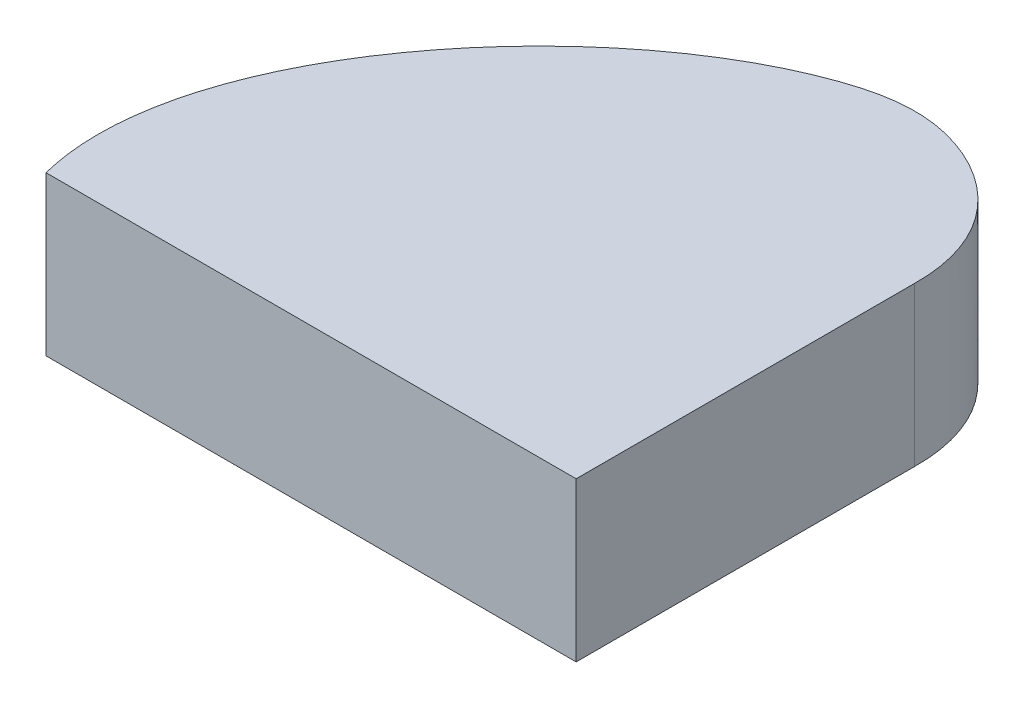
ISO-10303-21;
HEADER;
FILE_DESCRIPTION(('STEP AP214'),'2;1');
FILE_NAME('part.step','',(''),(''),'','','');
FILE_SCHEMA(('AUTOMOTIVE_DESIGN { 1 0 10303 214 1 1 1 1 }'));
ENDSEC;
DATA;
#1=APPLICATION_CONTEXT('core data for automotive mechanical design processes');
#2=APPLICATION_PROTOCOL_DEFINITION('international standard','automotive_design',2000,#1);
#3=PRODUCT_CONTEXT('',#1,'mechanical');
#4=PRODUCT('Part','Part','',(#3));
#5=PRODUCT_RELATED_PRODUCT_CATEGORY('part','',(#4));
#6=PRODUCT_DEFINITION_FORMATION('','',#4);
#7=PRODUCT_DEFINITION_CONTEXT('part definition',#1,'design');
#8=PRODUCT_DEFINITION('design','',#6,#7);
#9=PRODUCT_DEFINITION_SHAPE('','',#8);
#10=(LENGTH_UNIT() NAMED_UNIT(*) SI_UNIT(.MILLI.,.METRE.));
#11=(NAMED_UNIT(*) PLANE_ANGLE_UNIT() SI_UNIT($,.RADIAN.));
#12=(NAMED_UNIT(*) SI_UNIT($,.STERADIAN.) SOLID_ANGLE_UNIT());
#13=UNCERTAINTY_MEASURE_WITH_UNIT(LENGTH_MEASURE(1.E-05),#10,'distance_accuracy_value','');
#14=(GEOMETRIC_REPRESENTATION_CONTEXT(3) GLOBAL_UNCERTAINTY_ASSIGNED_CONTEXT((#13)) GLOBAL_UNIT_ASSIGNED_CONTEXT((#10,
#11,#12)) REPRESENTATION_CONTEXT('',''));
#15=CARTESIAN_POINT('',(0.,0.,0.));
#16=DIRECTION('',(0.,0.,1.));
#17=DIRECTION('',(1.,0.,0.));
#18=AXIS2_PLACEMENT_3D('',#15,#16,#17);
#19=CARTESIAN_POINT('',(21.2206082037952,6.35,-13.5336015959949));
#20=CARTESIAN_POINT('',(21.2702551268486,6.35,-17.0998291089668));
#21=CARTESIAN_POINT('',(17.0897299682767,6.35,-20.0713989765008));
#22=CARTESIAN_POINT('',(6.86936068897722,6.35,-18.0689027379659));
#23=CARTESIAN_POINT('',(-1.86465978077178,6.35,-7.33161820400332));
#24=CARTESIAN_POINT('',(0.,6.35,0.));
#25=B_SPLINE_CURVE_WITH_KNOTS('',3,(#19,#20,#21,#22,#23,#24),.UNSPECIFIED.,.F.,.F.,(4,1,1,4),
(0.,0.200636559356572,0.315852642641031,1.),.UNSPECIFIED.);
#26=DIRECTION('',(0.,-1.,0.));
#27=VECTOR('',#26,1.);
#28=SURFACE_OF_LINEAR_EXTRUSION('',#25,#27);
#29=CARTESIAN_POINT('',(21.2206082037952,0.,-13.5336015959949));
#30=CARTESIAN_POINT('',(21.2702551268486,0.,-17.0998291089668));
#31=CARTESIAN_POINT('',(17.0897299682767,0.,-20.0713989765008));
#32=CARTESIAN_POINT('',(6.86936068897722,0.,-18.0689027379659));
#33=CARTESIAN_POINT('',(-1.86465978077178,0.,-7.33161820400332));
#34=CARTESIAN_POINT('',(0.,0.,0.));
#35=B_SPLINE_CURVE_WITH_KNOTS('',3,(#29,#30,#31,#32,#33,#34),.UNSPECIFIED.,.F.,.F.,(4,1,1,4),
(0.,0.200636559356572,0.315852642641031,1.),.UNSPECIFIED.);
#36=CARTESIAN_POINT('',(21.2206082037952,0.,-13.5336015959949));
#37=VERTEX_POINT('',#36);
#38=CARTESIAN_POINT('',(0.,0.,0.));
#39=VERTEX_POINT('',#38);
#40=EDGE_CURVE('E80',#37,#39,#35,.T.);
#41=ORIENTED_EDGE('',*,*,#40,.T.);
#42=DIRECTION('',(0.,-1.,0.));
#43=VECTOR('',#42,1.);
#44=CARTESIAN_POINT('',(0.,6.35,0.));
#45=LINE('',#44,#43);
#46=CARTESIAN_POINT('',(0.,6.35,0.));
#47=VERTEX_POINT('',#46);
#48=EDGE_CURVE('E11',#47,#39,#45,.T.);
#49=ORIENTED_EDGE('',*,*,#48,.F.);
#50=CARTESIAN_POINT('',(21.2206082037952,6.35,-13.5336015959949));
#51=VERTEX_POINT('',#50);
#52=EDGE_CURVE('E74',#51,#47,#25,.T.);
#53=ORIENTED_EDGE('',*,*,#52,.F.);
#54=DIRECTION('',(0.,-1.,0.));
#55=VECTOR('',#54,1.);
#56=CARTESIAN_POINT('',(21.2206082037952,6.35,-13.5336015959949));
#57=LINE('',#56,#55);
#58=EDGE_CURVE('E81',#51,#37,#57,.T.);
#59=ORIENTED_EDGE('',*,*,#58,.T.);
#60=EDGE_LOOP('',(#41,#49,#53,#59));
#61=FACE_BOUND('',#60,.T.);
#62=ADVANCED_FACE('F33',(#61),#28,.F.);
#63=CARTESIAN_POINT('',(0.,6.35,0.));
#64=DIRECTION('',(0.,0.,-1.));
#65=DIRECTION('',(-1.,0.,0.));
#66=AXIS2_PLACEMENT_3D('',#63,#64,#65);
#67=PLANE('',#66);
#68=DIRECTION('',(1.,0.,0.));
#69=VECTOR('',#68,1.);
#70=CARTESIAN_POINT('',(0.,0.,0.));
#71=LINE('',#70,#69);
#72=CARTESIAN_POINT('',(21.2206082037952,0.,0.));
#73=VERTEX_POINT('',#72);
#74=EDGE_CURVE('E62',#39,#73,#71,.T.);
#75=ORIENTED_EDGE('',*,*,#74,.T.);
#76=DIRECTION('',(0.,-1.,0.));
#77=VECTOR('',#76,1.);
#78=CARTESIAN_POINT('',(21.2206082037952,6.35,0.));
#79=LINE('',#78,#77);
#80=CARTESIAN_POINT('',(21.2206082037952,6.35,0.));
#81=VERTEX_POINT('',#80);
#82=EDGE_CURVE('E42',#81,#73,#79,.T.);
#83=ORIENTED_EDGE('',*,*,#82,.F.);
#84=DIRECTION('',(1.,0.,0.));
#85=VECTOR('',#84,1.);
#86=CARTESIAN_POINT('',(0.,6.35,0.));
#87=LINE('',#86,#85);
#88=EDGE_CURVE('E70',#47,#81,#87,.T.);
#89=ORIENTED_EDGE('',*,*,#88,.F.);
#90=ORIENTED_EDGE('',*,*,#48,.T.);
#91=EDGE_LOOP('',(#75,#83,#89,#90));
#92=FACE_BOUND('',#91,.T.);
#93=ADVANCED_FACE('F71',(#92),#67,.F.);
#94=CARTESIAN_POINT('',(21.2206082037952,6.35,0.));
#95=DIRECTION('',(-1.,0.,0.));
#96=DIRECTION('',(0.,0.,1.));
#97=AXIS2_PLACEMENT_3D('',#94,#95,#96);
#98=PLANE('',#97);
#99=DIRECTION('',(0.,0.,-1.));
#100=VECTOR('',#99,1.);
#101=CARTESIAN_POINT('',(21.2206082037952,0.,0.));
#102=LINE('',#101,#100);
#103=EDGE_CURVE('E67',#73,#37,#102,.T.);
#104=ORIENTED_EDGE('',*,*,#103,.T.);
#105=ORIENTED_EDGE('',*,*,#58,.F.);
#106=DIRECTION('',(0.,0.,-1.));
#107=VECTOR('',#106,1.);
#108=CARTESIAN_POINT('',(21.2206082037952,6.35,0.));
#109=LINE('',#108,#107);
#110=EDGE_CURVE('E50',#81,#51,#109,.T.);
#111=ORIENTED_EDGE('',*,*,#110,.F.);
#112=ORIENTED_EDGE('',*,*,#82,.T.);
#113=EDGE_LOOP('',(#104,#105,#111,#112));
#114=FACE_BOUND('',#113,.T.);
#115=ADVANCED_FACE('F93',(#114),#98,.F.);
#116=CARTESIAN_POINT('',(7.07032188803286,6.35,-15.7141337347715));
#117=DIRECTION('',(0.,-1.,0.));
#118=DIRECTION('',(0.,0.,-1.));
#119=AXIS2_PLACEMENT_3D('',#116,#117,#118);
#120=PLANE('',#119);
#121=ORIENTED_EDGE('',*,*,#52,.T.);
#122=ORIENTED_EDGE('',*,*,#88,.T.);
#123=ORIENTED_EDGE('',*,*,#110,.T.);
#124=EDGE_LOOP('',(#121,#122,#123));
#125=FACE_BOUND('',#124,.T.);
#126=ADVANCED_FACE('F77',(#125),#120,.F.);
#127=CARTESIAN_POINT('',(7.07032188803286,0.,-15.7141337347715));
#128=DIRECTION('',(0.,-1.,0.));
#129=DIRECTION('',(0.,0.,-1.));
#130=AXIS2_PLACEMENT_3D('',#127,#128,#129);
#131=PLANE('',#130);
#132=ORIENTED_EDGE('',*,*,#40,.F.);
#133=ORIENTED_EDGE('',*,*,#103,.F.);
#134=ORIENTED_EDGE('',*,*,#74,.F.);
#135=EDGE_LOOP('',(#132,#133,#134));
#136=FACE_BOUND('',#135,.T.);
#137=ADVANCED_FACE('F94',(#136),#131,.T.);
#138=CLOSED_SHELL('',(#62,#93,#115,#126,#137));
#139=MANIFOLD_SOLID_BREP('B2',#138);
#140=ADVANCED_BREP_SHAPE_REPRESENTATION('',(#18,#139),#14);
#141=SHAPE_DEFINITION_REPRESENTATION(#9,#140);
ENDSEC;
END-ISO-10303-21;
